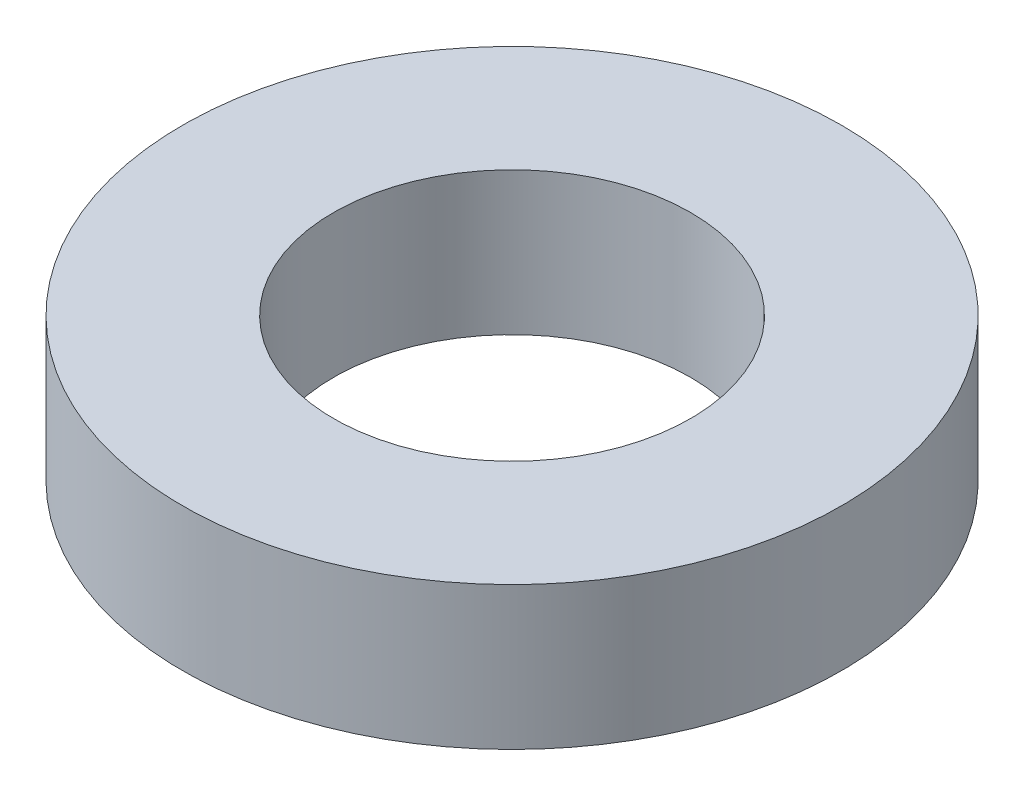
ISO-10303-21;
HEADER;
FILE_DESCRIPTION(('STEP AP214'),'2;1');
FILE_NAME('part.step','',(''),(''),'','','');
FILE_SCHEMA(('AUTOMOTIVE_DESIGN { 1 0 10303 214 1 1 1 1 }'));
ENDSEC;
DATA;
#1=APPLICATION_CONTEXT('core data for automotive mechanical design processes');
#2=APPLICATION_PROTOCOL_DEFINITION('international standard','automotive_design',2000,#1);
#3=PRODUCT_CONTEXT('',#1,'mechanical');
#4=PRODUCT('Part','Part','',(#3));
#5=PRODUCT_RELATED_PRODUCT_CATEGORY('part','',(#4));
#6=PRODUCT_DEFINITION_FORMATION('','',#4);
#7=PRODUCT_DEFINITION_CONTEXT('part definition',#1,'design');
#8=PRODUCT_DEFINITION('design','',#6,#7);
#9=PRODUCT_DEFINITION_SHAPE('','',#8);
#10=(LENGTH_UNIT() NAMED_UNIT(*) SI_UNIT(.MILLI.,.METRE.));
#11=(NAMED_UNIT(*) PLANE_ANGLE_UNIT() SI_UNIT($,.RADIAN.));
#12=(NAMED_UNIT(*) SI_UNIT($,.STERADIAN.) SOLID_ANGLE_UNIT());
#13=UNCERTAINTY_MEASURE_WITH_UNIT(LENGTH_MEASURE(1.E-05),#10,'distance_accuracy_value','');
#14=(GEOMETRIC_REPRESENTATION_CONTEXT(3) GLOBAL_UNCERTAINTY_ASSIGNED_CONTEXT((#13)) GLOBAL_UNIT_ASSIGNED_CONTEXT((#10,
#11,#12)) REPRESENTATION_CONTEXT('',''));
#15=CARTESIAN_POINT('',(0.,0.,0.));
#16=DIRECTION('',(0.,0.,1.));
#17=DIRECTION('',(1.,0.,0.));
#18=AXIS2_PLACEMENT_3D('',#15,#16,#17);
#19=CARTESIAN_POINT('',(0.,26.,0.));
#20=DIRECTION('',(0.,-1.,0.));
#21=DIRECTION('',(0.,0.,-1.));
#22=AXIS2_PLACEMENT_3D('',#19,#20,#21);
#23=CYLINDRICAL_SURFACE('',#22,60.);
#24=CARTESIAN_POINT('',(0.,26.,0.));
#25=DIRECTION('',(0.,1.,0.));
#26=DIRECTION('',(0.,0.,1.));
#27=AXIS2_PLACEMENT_3D('',#24,#25,#26);
#28=CIRCLE('',#27,60.);
#29=CARTESIAN_POINT('',(0.,26.,-60.));
#30=VERTEX_POINT('',#29);
#31=EDGE_CURVE('E10',#30,#30,#28,.T.);
#32=CARTESIAN_POINT('',(0.,0.,0.));
#33=DIRECTION('',(0.,1.,0.));
#34=DIRECTION('',(0.,0.,1.));
#35=AXIS2_PLACEMENT_3D('',#32,#33,#34);
#36=CIRCLE('',#35,60.);
#37=CARTESIAN_POINT('',(0.,0.,-60.));
#38=VERTEX_POINT('',#37);
#39=EDGE_CURVE('E37',#38,#38,#36,.T.);
#40=CARTESIAN_POINT('',(0.,26.,-60.));
#41=CARTESIAN_POINT('',(0.,25.7291666666667,-60.));
#42=CARTESIAN_POINT('',(0.,25.4583333333333,-60.));
#43=CARTESIAN_POINT('',(0.,24.9166666666667,-60.));
#44=CARTESIAN_POINT('',(0.,24.6458333333333,-60.));
#45=CARTESIAN_POINT('',(0.,24.1041666666667,-60.));
#46=CARTESIAN_POINT('',(0.,23.8333333333333,-60.));
#47=CARTESIAN_POINT('',(0.,23.2916666666667,-60.));
#48=CARTESIAN_POINT('',(0.,23.0208333333333,-60.));
#49=CARTESIAN_POINT('',(0.,22.4791666666667,-60.));
#50=CARTESIAN_POINT('',(0.,22.2083333333333,-60.));
#51=CARTESIAN_POINT('',(0.,21.6666666666667,-60.));
#52=CARTESIAN_POINT('',(0.,21.3958333333333,-60.));
#53=CARTESIAN_POINT('',(0.,20.8541666666667,-60.));
#54=CARTESIAN_POINT('',(0.,20.5833333333333,-60.));
#55=CARTESIAN_POINT('',(0.,20.0416666666667,-60.));
#56=CARTESIAN_POINT('',(0.,19.7708333333333,-60.));
#57=CARTESIAN_POINT('',(0.,19.2291666666667,-60.));
#58=CARTESIAN_POINT('',(0.,18.9583333333333,-60.));
#59=CARTESIAN_POINT('',(0.,18.4166666666667,-60.));
#60=CARTESIAN_POINT('',(0.,18.1458333333333,-60.));
#61=CARTESIAN_POINT('',(0.,17.6041666666667,-60.));
#62=CARTESIAN_POINT('',(0.,17.3333333333333,-60.));
#63=CARTESIAN_POINT('',(0.,16.7916666666667,-60.));
#64=CARTESIAN_POINT('',(0.,16.5208333333333,-60.));
#65=CARTESIAN_POINT('',(0.,15.9791666666667,-60.));
#66=CARTESIAN_POINT('',(0.,15.7083333333333,-60.));
#67=CARTESIAN_POINT('',(0.,15.1666666666667,-60.));
#68=CARTESIAN_POINT('',(0.,14.8958333333333,-60.));
#69=CARTESIAN_POINT('',(0.,14.3541666666667,-60.));
#70=CARTESIAN_POINT('',(0.,14.0833333333333,-60.));
#71=CARTESIAN_POINT('',(0.,13.5416666666667,-60.));
#72=CARTESIAN_POINT('',(0.,13.2708333333333,-60.));
#73=CARTESIAN_POINT('',(0.,12.7291666666667,-60.));
#74=CARTESIAN_POINT('',(0.,12.4583333333333,-60.));
#75=CARTESIAN_POINT('',(0.,11.9166666666667,-60.));
#76=CARTESIAN_POINT('',(0.,11.6458333333333,-60.));
#77=CARTESIAN_POINT('',(0.,11.1041666666667,-60.));
#78=CARTESIAN_POINT('',(0.,10.8333333333333,-60.));
#79=CARTESIAN_POINT('',(0.,10.2916666666667,-60.));
#80=CARTESIAN_POINT('',(0.,10.0208333333333,-60.));
#81=CARTESIAN_POINT('',(0.,9.47916666666667,-60.));
#82=CARTESIAN_POINT('',(0.,9.20833333333333,-60.));
#83=CARTESIAN_POINT('',(0.,8.66666666666667,-60.));
#84=CARTESIAN_POINT('',(0.,8.39583333333333,-60.));
#85=CARTESIAN_POINT('',(0.,7.85416666666667,-60.));
#86=CARTESIAN_POINT('',(0.,7.58333333333333,-60.));
#87=CARTESIAN_POINT('',(0.,7.04166666666667,-60.));
#88=CARTESIAN_POINT('',(0.,6.77083333333333,-60.));
#89=CARTESIAN_POINT('',(0.,6.22916666666667,-60.));
#90=CARTESIAN_POINT('',(0.,5.95833333333333,-60.));
#91=CARTESIAN_POINT('',(0.,5.41666666666667,-60.));
#92=CARTESIAN_POINT('',(0.,5.14583333333333,-60.));
#93=CARTESIAN_POINT('',(0.,4.60416666666667,-60.));
#94=CARTESIAN_POINT('',(0.,4.33333333333333,-60.));
#95=CARTESIAN_POINT('',(0.,3.79166666666667,-60.));
#96=CARTESIAN_POINT('',(0.,3.52083333333333,-60.));
#97=CARTESIAN_POINT('',(0.,2.97916666666667,-60.));
#98=CARTESIAN_POINT('',(0.,2.70833333333333,-60.));
#99=CARTESIAN_POINT('',(0.,2.16666666666667,-60.));
#100=CARTESIAN_POINT('',(0.,1.89583333333333,-60.));
#101=CARTESIAN_POINT('',(0.,1.35416666666667,-60.));
#102=CARTESIAN_POINT('',(0.,1.08333333333333,-60.));
#103=CARTESIAN_POINT('',(0.,0.541666666666667,-60.));
#104=CARTESIAN_POINT('',(0.,0.270833333333334,-60.));
#105=CARTESIAN_POINT('',(0.,0.,-60.));
#106=B_SPLINE_CURVE_WITH_KNOTS('',3,(#40,#41,#42,#43,#44,#45,#46,#47,#48,#49,#50,#51,#52,#53,
#54,#55,#56,#57,#58,#59,#60,#61,#62,#63,#64,#65,#66,#67,#68,#69,#70,#71,#72,#73,#74,#75,#76,#77,
#78,#79,#80,#81,#82,#83,#84,#85,#86,#87,#88,#89,#90,#91,#92,#93,#94,#95,#96,#97,#98,#99,#100,
#101,#102,#103,#104,#105),.UNSPECIFIED.,.F.,.F.,(4,2,2,2,2,2,2,2,2,2,2,2,2,2,2,2,2,2,2,2,2,2,2,
2,2,2,2,2,2,2,2,2,4),(0.,0.812499999999997,1.625,2.4375,3.25,4.0625,4.875,5.6875,6.5,7.3125,
8.125,8.93749999999999,9.74999999999999,10.5625,11.375,12.1875,13.,13.8125,14.625,15.4375,16.25,
17.0625,17.875,18.6875,19.5,20.3125,21.125,21.9375,22.75,23.5625,24.375,25.1875,26.),.UNSPECIFIED.);
#107=EDGE_CURVE('BSEAM40',#30,#38,#106,.T.);
#108=ORIENTED_EDGE('',*,*,#31,.F.);
#109=ORIENTED_EDGE('',*,*,#39,.T.);
#110=ORIENTED_EDGE('',*,*,#107,.T.);
#111=ORIENTED_EDGE('',*,*,#107,.F.);
#112=EDGE_LOOP('',(#108,#110,#109,#111));
#113=FACE_BOUND('',#112,.T.);
#114=ADVANCED_FACE('F40',(#113),#23,.T.);
#115=CARTESIAN_POINT('',(0.,26.,0.));
#116=DIRECTION('',(0.,1.,0.));
#117=DIRECTION('',(0.,0.,1.));
#118=AXIS2_PLACEMENT_3D('',#115,#116,#117);
#119=PLANE('',#118);
#120=CARTESIAN_POINT('',(0.,26.,0.));
#121=DIRECTION('',(0.,1.,0.));
#122=DIRECTION('',(0.,0.,1.));
#123=AXIS2_PLACEMENT_3D('',#120,#121,#122);
#124=CIRCLE('',#123,32.5);
#125=CARTESIAN_POINT('',(0.,26.,-32.5));
#126=VERTEX_POINT('',#125);
#127=EDGE_CURVE('E50',#126,#126,#124,.T.);
#128=ORIENTED_EDGE('',*,*,#127,.F.);
#129=EDGE_LOOP('',(#128));
#130=FACE_BOUND('',#129,.T.);
#131=ORIENTED_EDGE('',*,*,#31,.T.);
#132=EDGE_LOOP('',(#131));
#133=FACE_BOUND('',#132,.T.);
#134=ADVANCED_FACE('F59',(#130,#133),#119,.T.);
#135=CARTESIAN_POINT('',(0.,0.,0.));
#136=DIRECTION('',(0.,1.,0.));
#137=DIRECTION('',(0.,0.,1.));
#138=AXIS2_PLACEMENT_3D('',#135,#136,#137);
#139=PLANE('',#138);
#140=CARTESIAN_POINT('',(0.,0.,0.));
#141=DIRECTION('',(0.,1.,0.));
#142=DIRECTION('',(0.,0.,1.));
#143=AXIS2_PLACEMENT_3D('',#140,#141,#142);
#144=CIRCLE('',#143,32.5);
#145=CARTESIAN_POINT('',(0.,0.,-32.5));
#146=VERTEX_POINT('',#145);
#147=EDGE_CURVE('E47',#146,#146,#144,.T.);
#148=ORIENTED_EDGE('',*,*,#147,.T.);
#149=EDGE_LOOP('',(#148));
#150=FACE_BOUND('',#149,.T.);
#151=ORIENTED_EDGE('',*,*,#39,.F.);
#152=EDGE_LOOP('',(#151));
#153=FACE_BOUND('',#152,.T.);
#154=ADVANCED_FACE('F58',(#150,#153),#139,.F.);
#155=CARTESIAN_POINT('',(0.,26.,0.));
#156=DIRECTION('',(0.,-1.,0.));
#157=DIRECTION('',(0.,0.,-1.));
#158=AXIS2_PLACEMENT_3D('',#155,#156,#157);
#159=CYLINDRICAL_SURFACE('',#158,32.5);
#160=CARTESIAN_POINT('',(0.,26.,-32.5));
#161=CARTESIAN_POINT('',(0.,25.7291666666667,-32.5));
#162=CARTESIAN_POINT('',(0.,25.4583333333333,-32.5));
#163=CARTESIAN_POINT('',(0.,24.9166666666667,-32.5));
#164=CARTESIAN_POINT('',(0.,24.6458333333333,-32.5));
#165=CARTESIAN_POINT('',(0.,24.1041666666667,-32.5));
#166=CARTESIAN_POINT('',(0.,23.8333333333333,-32.5));
#167=CARTESIAN_POINT('',(0.,23.2916666666667,-32.5));
#168=CARTESIAN_POINT('',(0.,23.0208333333333,-32.5));
#169=CARTESIAN_POINT('',(0.,22.4791666666667,-32.5));
#170=CARTESIAN_POINT('',(0.,22.2083333333333,-32.5));
#171=CARTESIAN_POINT('',(0.,21.6666666666667,-32.5));
#172=CARTESIAN_POINT('',(0.,21.3958333333333,-32.5));
#173=CARTESIAN_POINT('',(0.,20.8541666666667,-32.5));
#174=CARTESIAN_POINT('',(0.,20.5833333333333,-32.5));
#175=CARTESIAN_POINT('',(0.,20.0416666666667,-32.5));
#176=CARTESIAN_POINT('',(0.,19.7708333333333,-32.5));
#177=CARTESIAN_POINT('',(0.,19.2291666666667,-32.5));
#178=CARTESIAN_POINT('',(0.,18.9583333333333,-32.5));
#179=CARTESIAN_POINT('',(0.,18.4166666666667,-32.5));
#180=CARTESIAN_POINT('',(0.,18.1458333333333,-32.5));
#181=CARTESIAN_POINT('',(0.,17.6041666666667,-32.5));
#182=CARTESIAN_POINT('',(0.,17.3333333333333,-32.5));
#183=CARTESIAN_POINT('',(0.,16.7916666666667,-32.5));
#184=CARTESIAN_POINT('',(0.,16.5208333333333,-32.5));
#185=CARTESIAN_POINT('',(0.,15.9791666666667,-32.5));
#186=CARTESIAN_POINT('',(0.,15.7083333333333,-32.5));
#187=CARTESIAN_POINT('',(0.,15.1666666666667,-32.5));
#188=CARTESIAN_POINT('',(0.,14.8958333333333,-32.5));
#189=CARTESIAN_POINT('',(0.,14.3541666666667,-32.5));
#190=CARTESIAN_POINT('',(0.,14.0833333333333,-32.5));
#191=CARTESIAN_POINT('',(0.,13.5416666666667,-32.5));
#192=CARTESIAN_POINT('',(0.,13.2708333333333,-32.5));
#193=CARTESIAN_POINT('',(0.,12.7291666666667,-32.5));
#194=CARTESIAN_POINT('',(0.,12.4583333333333,-32.5));
#195=CARTESIAN_POINT('',(0.,11.9166666666667,-32.5));
#196=CARTESIAN_POINT('',(0.,11.6458333333333,-32.5));
#197=CARTESIAN_POINT('',(0.,11.1041666666667,-32.5));
#198=CARTESIAN_POINT('',(0.,10.8333333333333,-32.5));
#199=CARTESIAN_POINT('',(0.,10.2916666666667,-32.5));
#200=CARTESIAN_POINT('',(0.,10.0208333333333,-32.5));
#201=CARTESIAN_POINT('',(0.,9.47916666666667,-32.5));
#202=CARTESIAN_POINT('',(0.,9.20833333333333,-32.5));
#203=CARTESIAN_POINT('',(0.,8.66666666666667,-32.5));
#204=CARTESIAN_POINT('',(0.,8.39583333333333,-32.5));
#205=CARTESIAN_POINT('',(0.,7.85416666666667,-32.5));
#206=CARTESIAN_POINT('',(0.,7.58333333333333,-32.5));
#207=CARTESIAN_POINT('',(0.,7.04166666666667,-32.5));
#208=CARTESIAN_POINT('',(0.,6.77083333333333,-32.5));
#209=CARTESIAN_POINT('',(0.,6.22916666666667,-32.5));
#210=CARTESIAN_POINT('',(0.,5.95833333333333,-32.5));
#211=CARTESIAN_POINT('',(0.,5.41666666666667,-32.5));
#212=CARTESIAN_POINT('',(0.,5.14583333333333,-32.5));
#213=CARTESIAN_POINT('',(0.,4.60416666666667,-32.5));
#214=CARTESIAN_POINT('',(0.,4.33333333333333,-32.5));
#215=CARTESIAN_POINT('',(0.,3.79166666666667,-32.5));
#216=CARTESIAN_POINT('',(0.,3.52083333333333,-32.5));
#217=CARTESIAN_POINT('',(0.,2.97916666666667,-32.5));
#218=CARTESIAN_POINT('',(0.,2.70833333333333,-32.5));
#219=CARTESIAN_POINT('',(0.,2.16666666666667,-32.5));
#220=CARTESIAN_POINT('',(0.,1.89583333333333,-32.5));
#221=CARTESIAN_POINT('',(0.,1.35416666666667,-32.5));
#222=CARTESIAN_POINT('',(0.,1.08333333333333,-32.5));
#223=CARTESIAN_POINT('',(0.,0.541666666666667,-32.5));
#224=CARTESIAN_POINT('',(0.,0.270833333333334,-32.5));
#225=CARTESIAN_POINT('',(0.,0.,-32.5));
#226=B_SPLINE_CURVE_WITH_KNOTS('',3,(#160,#161,#162,#163,#164,#165,#166,#167,#168,#169,#170,
#171,#172,#173,#174,#175,#176,#177,#178,#179,#180,#181,#182,#183,#184,#185,#186,#187,#188,#189,
#190,#191,#192,#193,#194,#195,#196,#197,#198,#199,#200,#201,#202,#203,#204,#205,#206,#207,#208,
#209,#210,#211,#212,#213,#214,#215,#216,#217,#218,#219,#220,#221,#222,#223,#224,#225),
.UNSPECIFIED.,.F.,.F.,(4,2,2,2,2,2,2,2,2,2,2,2,2,2,2,2,2,2,2,2,2,2,2,2,2,2,2,2,2,2,2,2,4),(0.,
0.812500000000001,1.625,2.4375,3.25,4.0625,4.875,5.6875,6.5,7.3125,8.125,8.9375,9.75,10.5625,
11.375,12.1875,13.,13.8125,14.625,15.4375,16.25,17.0625,17.875,18.6875,19.5,20.3125,21.125,
21.9375,22.75,23.5625,24.375,25.1875,26.),.UNSPECIFIED.);
#227=EDGE_CURVE('BSEAM54',#126,#146,#226,.T.);
#228=ORIENTED_EDGE('',*,*,#127,.T.);
#229=ORIENTED_EDGE('',*,*,#147,.F.);
#230=ORIENTED_EDGE('',*,*,#227,.T.);
#231=ORIENTED_EDGE('',*,*,#227,.F.);
#232=EDGE_LOOP('',(#228,#230,#229,#231));
#233=FACE_BOUND('',#232,.T.);
#234=ADVANCED_FACE('F54',(#233),#159,.F.);
#235=CLOSED_SHELL('',(#114,#134,#154,#234));
#236=MANIFOLD_SOLID_BREP('B2',#235);
#237=ADVANCED_BREP_SHAPE_REPRESENTATION('',(#18,#236),#14);
#238=SHAPE_DEFINITION_REPRESENTATION(#9,#237);
ENDSEC;
END-ISO-10303-21;
